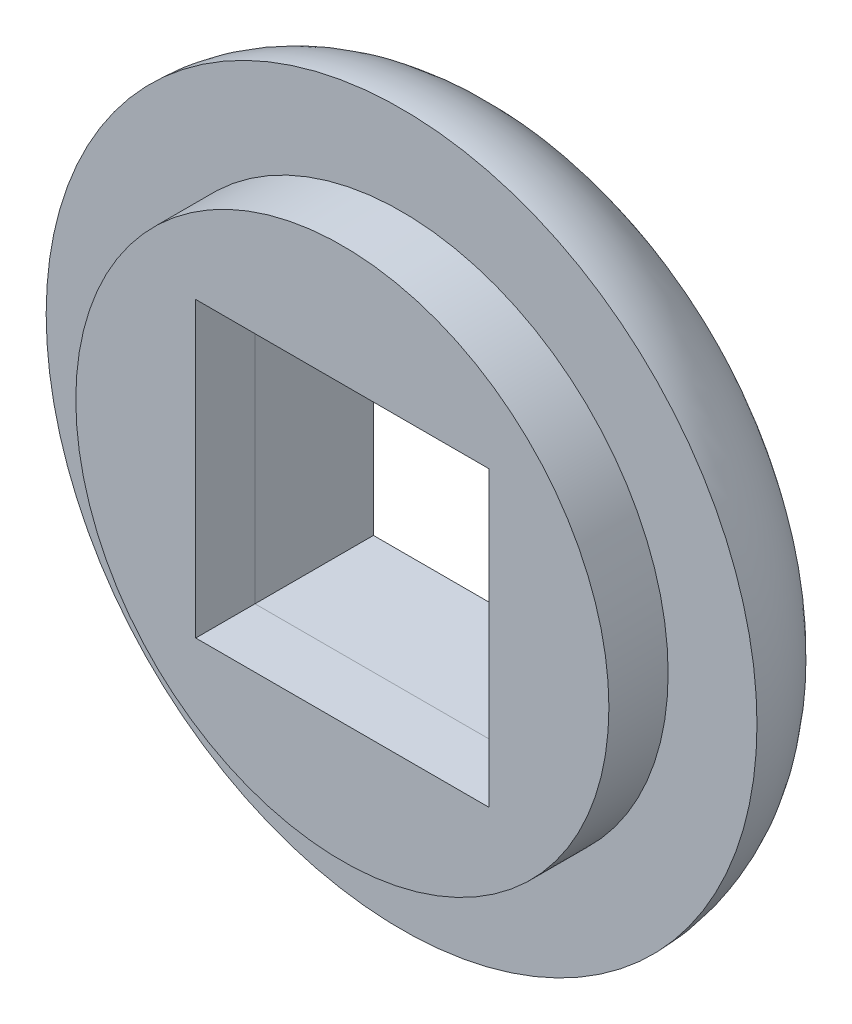
ISO-10303-21;
HEADER;
FILE_DESCRIPTION(('STEP AP214'),'2;1');
FILE_NAME('part.step','',(''),(''),'','','');
FILE_SCHEMA(('AUTOMOTIVE_DESIGN { 1 0 10303 214 1 1 1 1 }'));
ENDSEC;
DATA;
#1=APPLICATION_CONTEXT('core data for automotive mechanical design processes');
#2=APPLICATION_PROTOCOL_DEFINITION('international standard','automotive_design',2000,#1);
#3=PRODUCT_CONTEXT('',#1,'mechanical');
#4=PRODUCT('Part','Part','',(#3));
#5=PRODUCT_RELATED_PRODUCT_CATEGORY('part','',(#4));
#6=PRODUCT_DEFINITION_FORMATION('','',#4);
#7=PRODUCT_DEFINITION_CONTEXT('part definition',#1,'design');
#8=PRODUCT_DEFINITION('design','',#6,#7);
#9=PRODUCT_DEFINITION_SHAPE('','',#8);
#10=(LENGTH_UNIT() NAMED_UNIT(*) SI_UNIT(.MILLI.,.METRE.));
#11=(NAMED_UNIT(*) PLANE_ANGLE_UNIT() SI_UNIT($,.RADIAN.));
#12=(NAMED_UNIT(*) SI_UNIT($,.STERADIAN.) SOLID_ANGLE_UNIT());
#13=UNCERTAINTY_MEASURE_WITH_UNIT(LENGTH_MEASURE(1.E-05),#10,'distance_accuracy_value','');
#14=(GEOMETRIC_REPRESENTATION_CONTEXT(3) GLOBAL_UNCERTAINTY_ASSIGNED_CONTEXT((#13)) GLOBAL_UNIT_ASSIGNED_CONTEXT((#10,
#11,#12)) REPRESENTATION_CONTEXT('',''));
#15=CARTESIAN_POINT('',(0.,0.,0.));
#16=DIRECTION('',(0.,0.,1.));
#17=DIRECTION('',(1.,0.,0.));
#18=AXIS2_PLACEMENT_3D('',#15,#16,#17);
#19=CARTESIAN_POINT('',(0.,0.,-2.));
#20=DIRECTION('',(0.,0.,-1.));
#21=DIRECTION('',(-1.,0.,0.));
#22=AXIS2_PLACEMENT_3D('',#19,#20,#21);
#23=PLANE('',#22);
#24=CARTESIAN_POINT('',(0.,0.,-2.));
#25=DIRECTION('',(0.,0.,-1.));
#26=DIRECTION('',(-1.,0.,0.));
#27=AXIS2_PLACEMENT_3D('',#24,#25,#26);
#28=CIRCLE('',#27,4.);
#29=CARTESIAN_POINT('',(-4.,0.,-2.));
#30=VERTEX_POINT('',#29);
#31=EDGE_CURVE('E12',#30,#30,#28,.T.);
#32=ORIENTED_EDGE('',*,*,#31,.T.);
#33=EDGE_LOOP('',(#32));
#34=FACE_BOUND('',#33,.T.);
#35=DIRECTION('',(0.,-1.,0.));
#36=VECTOR('',#35,1.);
#37=CARTESIAN_POINT('',(2.47487373415292,2.47487373415292,-2.));
#38=LINE('',#37,#36);
#39=CARTESIAN_POINT('',(2.47487373415292,2.47487373415292,-2.));
#40=VERTEX_POINT('',#39);
#41=CARTESIAN_POINT('',(2.47487373415292,-2.47487373415292,-2.));
#42=VERTEX_POINT('',#41);
#43=EDGE_CURVE('E93',#40,#42,#38,.T.);
#44=ORIENTED_EDGE('',*,*,#43,.F.);
#45=DIRECTION('',(1.,0.,0.));
#46=VECTOR('',#45,1.);
#47=CARTESIAN_POINT('',(-2.47487373415292,2.47487373415292,-2.));
#48=LINE('',#47,#46);
#49=CARTESIAN_POINT('',(-2.47487373415292,2.47487373415292,-2.));
#50=VERTEX_POINT('',#49);
#51=EDGE_CURVE('E85',#50,#40,#48,.T.);
#52=ORIENTED_EDGE('',*,*,#51,.F.);
#53=DIRECTION('',(0.,1.,0.));
#54=VECTOR('',#53,1.);
#55=CARTESIAN_POINT('',(-2.47487373415292,-2.47487373415292,-2.));
#56=LINE('',#55,#54);
#57=CARTESIAN_POINT('',(-2.47487373415292,-2.47487373415292,-2.));
#58=VERTEX_POINT('',#57);
#59=EDGE_CURVE('E106',#58,#50,#56,.T.);
#60=ORIENTED_EDGE('',*,*,#59,.F.);
#61=DIRECTION('',(-1.,0.,0.));
#62=VECTOR('',#61,1.);
#63=CARTESIAN_POINT('',(2.47487373415292,-2.47487373415292,-2.));
#64=LINE('',#63,#62);
#65=EDGE_CURVE('E104',#42,#58,#64,.T.);
#66=ORIENTED_EDGE('',*,*,#65,.F.);
#67=EDGE_LOOP('',(#44,#52,#60,#66));
#68=FACE_BOUND('',#67,.T.);
#69=ADVANCED_FACE('F44',(#34,#68),#23,.T.);
#70=CARTESIAN_POINT('',(0.,0.,0.));
#71=DIRECTION('',(0.,0.,-1.));
#72=DIRECTION('',(-1.,0.,0.));
#73=AXIS2_PLACEMENT_3D('',#70,#71,#72);
#74=PLANE('',#73);
#75=CARTESIAN_POINT('',(0.,0.,0.));
#76=DIRECTION('',(0.,0.,-1.));
#77=DIRECTION('',(-1.,0.,0.));
#78=AXIS2_PLACEMENT_3D('',#75,#76,#77);
#79=CIRCLE('',#78,6.);
#80=CARTESIAN_POINT('',(-6.,0.,0.));
#81=VERTEX_POINT('',#80);
#82=EDGE_CURVE('E52',#81,#81,#79,.T.);
#83=ORIENTED_EDGE('',*,*,#82,.F.);
#84=EDGE_LOOP('',(#83));
#85=FACE_BOUND('',#84,.T.);
#86=DIRECTION('',(1.,0.,0.));
#87=VECTOR('',#86,1.);
#88=CARTESIAN_POINT('',(-2.47487373415292,2.47487373415292,0.));
#89=LINE('',#88,#87);
#90=CARTESIAN_POINT('',(-2.47487373415292,2.47487373415292,0.));
#91=VERTEX_POINT('',#90);
#92=CARTESIAN_POINT('',(2.47487373415292,2.47487373415292,0.));
#93=VERTEX_POINT('',#92);
#94=EDGE_CURVE('E67',#91,#93,#89,.T.);
#95=ORIENTED_EDGE('',*,*,#94,.T.);
#96=DIRECTION('',(0.,-1.,0.));
#97=VECTOR('',#96,1.);
#98=CARTESIAN_POINT('',(2.47487373415292,2.47487373415292,0.));
#99=LINE('',#98,#97);
#100=CARTESIAN_POINT('',(2.47487373415292,-2.47487373415292,0.));
#101=VERTEX_POINT('',#100);
#102=EDGE_CURVE('E100',#93,#101,#99,.T.);
#103=ORIENTED_EDGE('',*,*,#102,.T.);
#104=DIRECTION('',(-1.,0.,0.));
#105=VECTOR('',#104,1.);
#106=CARTESIAN_POINT('',(2.47487373415292,-2.47487373415292,0.));
#107=LINE('',#106,#105);
#108=CARTESIAN_POINT('',(-2.47487373415292,-2.47487373415292,0.));
#109=VERTEX_POINT('',#108);
#110=EDGE_CURVE('E112',#101,#109,#107,.T.);
#111=ORIENTED_EDGE('',*,*,#110,.T.);
#112=DIRECTION('',(0.,1.,0.));
#113=VECTOR('',#112,1.);
#114=CARTESIAN_POINT('',(-2.47487373415292,-2.47487373415292,0.));
#115=LINE('',#114,#113);
#116=EDGE_CURVE('E94',#109,#91,#115,.T.);
#117=ORIENTED_EDGE('',*,*,#116,.T.);
#118=EDGE_LOOP('',(#95,#103,#111,#117));
#119=FACE_BOUND('',#118,.T.);
#120=ADVANCED_FACE('F124',(#85,#119),#74,.F.);
#121=CARTESIAN_POINT('',(-2.47487373415292,2.47487373415292,-2.));
#122=DIRECTION('',(0.,-1.,0.));
#123=DIRECTION('',(1.,0.,0.));
#124=AXIS2_PLACEMENT_3D('',#121,#122,#123);
#125=PLANE('',#124);
#126=ORIENTED_EDGE('',*,*,#94,.F.);
#127=DIRECTION('',(0.,0.,1.));
#128=VECTOR('',#127,1.);
#129=CARTESIAN_POINT('',(-2.47487373415292,2.47487373415292,-2.));
#130=LINE('',#129,#128);
#131=EDGE_CURVE('E89',#50,#91,#130,.T.);
#132=ORIENTED_EDGE('',*,*,#131,.F.);
#133=ORIENTED_EDGE('',*,*,#51,.T.);
#134=DIRECTION('',(0.,0.,1.));
#135=VECTOR('',#134,1.);
#136=CARTESIAN_POINT('',(2.47487373415292,2.47487373415292,-2.));
#137=LINE('',#136,#135);
#138=EDGE_CURVE('E88',#40,#93,#137,.T.);
#139=ORIENTED_EDGE('',*,*,#138,.T.);
#140=EDGE_LOOP('',(#126,#132,#133,#139));
#141=FACE_BOUND('',#140,.T.);
#142=ADVANCED_FACE('F87',(#141),#125,.T.);
#143=CARTESIAN_POINT('',(2.47487373415292,2.47487373415292,-2.));
#144=DIRECTION('',(-1.,0.,0.));
#145=DIRECTION('',(0.,-1.,0.));
#146=AXIS2_PLACEMENT_3D('',#143,#144,#145);
#147=PLANE('',#146);
#148=ORIENTED_EDGE('',*,*,#102,.F.);
#149=ORIENTED_EDGE('',*,*,#138,.F.);
#150=ORIENTED_EDGE('',*,*,#43,.T.);
#151=DIRECTION('',(0.,0.,1.));
#152=VECTOR('',#151,1.);
#153=CARTESIAN_POINT('',(2.47487373415292,-2.47487373415292,-2.));
#154=LINE('',#153,#152);
#155=EDGE_CURVE('E101',#42,#101,#154,.T.);
#156=ORIENTED_EDGE('',*,*,#155,.T.);
#157=EDGE_LOOP('',(#148,#149,#150,#156));
#158=FACE_BOUND('',#157,.T.);
#159=ADVANCED_FACE('F97',(#158),#147,.T.);
#160=CARTESIAN_POINT('',(2.47487373415292,-2.47487373415292,-2.));
#161=DIRECTION('',(0.,1.,0.));
#162=DIRECTION('',(-1.,0.,0.));
#163=AXIS2_PLACEMENT_3D('',#160,#161,#162);
#164=PLANE('',#163);
#165=ORIENTED_EDGE('',*,*,#110,.F.);
#166=ORIENTED_EDGE('',*,*,#155,.F.);
#167=ORIENTED_EDGE('',*,*,#65,.T.);
#168=DIRECTION('',(0.,0.,1.));
#169=VECTOR('',#168,1.);
#170=CARTESIAN_POINT('',(-2.47487373415292,-2.47487373415292,-2.));
#171=LINE('',#170,#169);
#172=EDGE_CURVE('E59',#58,#109,#171,.T.);
#173=ORIENTED_EDGE('',*,*,#172,.T.);
#174=EDGE_LOOP('',(#165,#166,#167,#173));
#175=FACE_BOUND('',#174,.T.);
#176=ADVANCED_FACE('F130',(#175),#164,.T.);
#177=CARTESIAN_POINT('',(-2.47487373415292,-2.47487373415292,-2.));
#178=DIRECTION('',(1.,0.,0.));
#179=DIRECTION('',(0.,1.,0.));
#180=AXIS2_PLACEMENT_3D('',#177,#178,#179);
#181=PLANE('',#180);
#182=ORIENTED_EDGE('',*,*,#116,.F.);
#183=ORIENTED_EDGE('',*,*,#172,.F.);
#184=ORIENTED_EDGE('',*,*,#59,.T.);
#185=ORIENTED_EDGE('',*,*,#131,.T.);
#186=EDGE_LOOP('',(#182,#183,#184,#185));
#187=FACE_BOUND('',#186,.T.);
#188=ADVANCED_FACE('F128',(#187),#181,.T.);
#189=CARTESIAN_POINT('',(0.,0.,0.));
#190=DIRECTION('',(0.,0.,-1.));
#191=DIRECTION('',(-1.,0.,0.));
#192=AXIS2_PLACEMENT_3D('',#189,#190,#191);
#193=TOROIDAL_SURFACE('',#192,4.,2.);
#194=ORIENTED_EDGE('',*,*,#82,.T.);
#195=EDGE_LOOP('',(#194));
#196=FACE_BOUND('',#195,.T.);
#197=ORIENTED_EDGE('',*,*,#31,.F.);
#198=EDGE_LOOP('',(#197));
#199=FACE_BOUND('',#198,.T.);
#200=ADVANCED_FACE('F46',(#196,#199),#193,.T.);
#201=CLOSED_SHELL('',(#69,#120,#142,#159,#176,#188,#200));
#202=MANIFOLD_SOLID_BREP('B2',#201);
#203=CARTESIAN_POINT('',(0.,0.,1.));
#204=DIRECTION('',(0.,0.,1.));
#205=DIRECTION('',(1.,0.,0.));
#206=AXIS2_PLACEMENT_3D('',#203,#204,#205);
#207=PLANE('',#206);
#208=CARTESIAN_POINT('',(0.,0.,1.));
#209=DIRECTION('',(0.,0.,1.));
#210=DIRECTION('',(1.,0.,0.));
#211=AXIS2_PLACEMENT_3D('',#208,#209,#210);
#212=CIRCLE('',#211,4.5);
#213=CARTESIAN_POINT('',(4.5,0.,1.));
#214=VERTEX_POINT('',#213);
#215=EDGE_CURVE('E42',#214,#214,#212,.T.);
#216=ORIENTED_EDGE('',*,*,#215,.T.);
#217=EDGE_LOOP('',(#216));
#218=FACE_BOUND('',#217,.T.);
#219=DIRECTION('',(1.,0.,0.));
#220=VECTOR('',#219,1.);
#221=CARTESIAN_POINT('',(2.47487373415292,-2.47487373415292,1.));
#222=LINE('',#221,#220);
#223=CARTESIAN_POINT('',(-2.47487373415292,-2.47487373415292,1.));
#224=VERTEX_POINT('',#223);
#225=CARTESIAN_POINT('',(2.47487373415292,-2.47487373415292,1.));
#226=VERTEX_POINT('',#225);
#227=EDGE_CURVE('E237',#224,#226,#222,.T.);
#228=ORIENTED_EDGE('',*,*,#227,.F.);
#229=DIRECTION('',(0.,-1.,0.));
#230=VECTOR('',#229,1.);
#231=CARTESIAN_POINT('',(-2.47487373415292,2.47487373415292,1.));
#232=LINE('',#231,#230);
#233=CARTESIAN_POINT('',(-2.47487373415292,2.47487373415292,1.));
#234=VERTEX_POINT('',#233);
#235=EDGE_CURVE('E229',#234,#224,#232,.T.);
#236=ORIENTED_EDGE('',*,*,#235,.F.);
#237=DIRECTION('',(-1.,0.,0.));
#238=VECTOR('',#237,1.);
#239=CARTESIAN_POINT('',(2.47487373415292,2.47487373415292,1.));
#240=LINE('',#239,#238);
#241=CARTESIAN_POINT('',(2.47487373415292,2.47487373415292,1.));
#242=VERTEX_POINT('',#241);
#243=EDGE_CURVE('E250',#242,#234,#240,.T.);
#244=ORIENTED_EDGE('',*,*,#243,.F.);
#245=DIRECTION('',(0.,1.,0.));
#246=VECTOR('',#245,1.);
#247=CARTESIAN_POINT('',(2.47487373415292,2.47487373415292,1.));
#248=LINE('',#247,#246);
#249=EDGE_CURVE('E248',#226,#242,#248,.T.);
#250=ORIENTED_EDGE('',*,*,#249,.F.);
#251=EDGE_LOOP('',(#228,#236,#244,#250));
#252=FACE_BOUND('',#251,.T.);
#253=ADVANCED_FACE('F188',(#218,#252),#207,.T.);
#254=CARTESIAN_POINT('',(0.,0.,0.));
#255=DIRECTION('',(0.,0.,1.));
#256=DIRECTION('',(1.,0.,0.));
#257=AXIS2_PLACEMENT_3D('',#254,#255,#256);
#258=PLANE('',#257);
#259=CARTESIAN_POINT('',(0.,0.,0.));
#260=DIRECTION('',(0.,0.,1.));
#261=DIRECTION('',(1.,0.,0.));
#262=AXIS2_PLACEMENT_3D('',#259,#260,#261);
#263=CIRCLE('',#262,4.5);
#264=CARTESIAN_POINT('',(4.5,0.,0.));
#265=VERTEX_POINT('',#264);
#266=EDGE_CURVE('E192',#265,#265,#263,.T.);
#267=ORIENTED_EDGE('',*,*,#266,.F.);
#268=EDGE_LOOP('',(#267));
#269=FACE_BOUND('',#268,.T.);
#270=DIRECTION('',(0.,-1.,0.));
#271=VECTOR('',#270,1.);
#272=CARTESIAN_POINT('',(-2.47487373415292,2.47487373415292,0.));
#273=LINE('',#272,#271);
#274=CARTESIAN_POINT('',(-2.47487373415292,2.47487373415292,0.));
#275=VERTEX_POINT('',#274);
#276=CARTESIAN_POINT('',(-2.47487373415292,-2.47487373415292,0.));
#277=VERTEX_POINT('',#276);
#278=EDGE_CURVE('E211',#275,#277,#273,.T.);
#279=ORIENTED_EDGE('',*,*,#278,.T.);
#280=DIRECTION('',(1.,0.,0.));
#281=VECTOR('',#280,1.);
#282=CARTESIAN_POINT('',(2.47487373415292,-2.47487373415292,0.));
#283=LINE('',#282,#281);
#284=CARTESIAN_POINT('',(2.47487373415292,-2.47487373415292,0.));
#285=VERTEX_POINT('',#284);
#286=EDGE_CURVE('E244',#277,#285,#283,.T.);
#287=ORIENTED_EDGE('',*,*,#286,.T.);
#288=DIRECTION('',(0.,1.,0.));
#289=VECTOR('',#288,1.);
#290=CARTESIAN_POINT('',(2.47487373415292,2.47487373415292,0.));
#291=LINE('',#290,#289);
#292=CARTESIAN_POINT('',(2.47487373415292,2.47487373415292,0.));
#293=VERTEX_POINT('',#292);
#294=EDGE_CURVE('E256',#285,#293,#291,.T.);
#295=ORIENTED_EDGE('',*,*,#294,.T.);
#296=DIRECTION('',(-1.,0.,0.));
#297=VECTOR('',#296,1.);
#298=CARTESIAN_POINT('',(2.47487373415292,2.47487373415292,0.));
#299=LINE('',#298,#297);
#300=EDGE_CURVE('E238',#293,#275,#299,.T.);
#301=ORIENTED_EDGE('',*,*,#300,.T.);
#302=EDGE_LOOP('',(#279,#287,#295,#301));
#303=FACE_BOUND('',#302,.T.);
#304=ADVANCED_FACE('F267',(#269,#303),#258,.F.);
#305=CARTESIAN_POINT('',(0.,0.,1.));
#306=DIRECTION('',(0.,0.,-1.));
#307=DIRECTION('',(-1.,0.,0.));
#308=AXIS2_PLACEMENT_3D('',#305,#306,#307);
#309=CYLINDRICAL_SURFACE('',#308,4.5);
#310=ORIENTED_EDGE('',*,*,#215,.F.);
#311=EDGE_LOOP('',(#310));
#312=FACE_BOUND('',#311,.T.);
#313=ORIENTED_EDGE('',*,*,#266,.T.);
#314=EDGE_LOOP('',(#313));
#315=FACE_BOUND('',#314,.T.);
#316=ADVANCED_FACE('F190',(#312,#315),#309,.T.);
#317=CARTESIAN_POINT('',(-2.47487373415292,2.47487373415292,1.));
#318=DIRECTION('',(1.,0.,0.));
#319=DIRECTION('',(0.,1.,0.));
#320=AXIS2_PLACEMENT_3D('',#317,#318,#319);
#321=PLANE('',#320);
#322=ORIENTED_EDGE('',*,*,#278,.F.);
#323=DIRECTION('',(0.,0.,-1.));
#324=VECTOR('',#323,1.);
#325=CARTESIAN_POINT('',(-2.47487373415292,2.47487373415292,1.));
#326=LINE('',#325,#324);
#327=EDGE_CURVE('E233',#234,#275,#326,.T.);
#328=ORIENTED_EDGE('',*,*,#327,.F.);
#329=ORIENTED_EDGE('',*,*,#235,.T.);
#330=DIRECTION('',(0.,0.,-1.));
#331=VECTOR('',#330,1.);
#332=CARTESIAN_POINT('',(-2.47487373415292,-2.47487373415292,1.));
#333=LINE('',#332,#331);
#334=EDGE_CURVE('E232',#224,#277,#333,.T.);
#335=ORIENTED_EDGE('',*,*,#334,.T.);
#336=EDGE_LOOP('',(#322,#328,#329,#335));
#337=FACE_BOUND('',#336,.T.);
#338=ADVANCED_FACE('F231',(#337),#321,.T.);
#339=CARTESIAN_POINT('',(2.47487373415292,-2.47487373415292,1.));
#340=DIRECTION('',(0.,1.,0.));
#341=DIRECTION('',(-1.,0.,0.));
#342=AXIS2_PLACEMENT_3D('',#339,#340,#341);
#343=PLANE('',#342);
#344=ORIENTED_EDGE('',*,*,#286,.F.);
#345=ORIENTED_EDGE('',*,*,#334,.F.);
#346=ORIENTED_EDGE('',*,*,#227,.T.);
#347=DIRECTION('',(0.,0.,-1.));
#348=VECTOR('',#347,1.);
#349=CARTESIAN_POINT('',(2.47487373415292,-2.47487373415292,1.));
#350=LINE('',#349,#348);
#351=EDGE_CURVE('E245',#226,#285,#350,.T.);
#352=ORIENTED_EDGE('',*,*,#351,.T.);
#353=EDGE_LOOP('',(#344,#345,#346,#352));
#354=FACE_BOUND('',#353,.T.);
#355=ADVANCED_FACE('F241',(#354),#343,.T.);
#356=CARTESIAN_POINT('',(2.47487373415292,2.47487373415292,1.));
#357=DIRECTION('',(-1.,0.,0.));
#358=DIRECTION('',(0.,-1.,0.));
#359=AXIS2_PLACEMENT_3D('',#356,#357,#358);
#360=PLANE('',#359);
#361=ORIENTED_EDGE('',*,*,#294,.F.);
#362=ORIENTED_EDGE('',*,*,#351,.F.);
#363=ORIENTED_EDGE('',*,*,#249,.T.);
#364=DIRECTION('',(0.,0.,-1.));
#365=VECTOR('',#364,1.);
#366=CARTESIAN_POINT('',(2.47487373415292,2.47487373415292,1.));
#367=LINE('',#366,#365);
#368=EDGE_CURVE('E203',#242,#293,#367,.T.);
#369=ORIENTED_EDGE('',*,*,#368,.T.);
#370=EDGE_LOOP('',(#361,#362,#363,#369));
#371=FACE_BOUND('',#370,.T.);
#372=ADVANCED_FACE('F265',(#371),#360,.T.);
#373=CARTESIAN_POINT('',(2.47487373415292,2.47487373415292,1.));
#374=DIRECTION('',(0.,-1.,0.));
#375=DIRECTION('',(1.,0.,0.));
#376=AXIS2_PLACEMENT_3D('',#373,#374,#375);
#377=PLANE('',#376);
#378=ORIENTED_EDGE('',*,*,#300,.F.);
#379=ORIENTED_EDGE('',*,*,#368,.F.);
#380=ORIENTED_EDGE('',*,*,#243,.T.);
#381=ORIENTED_EDGE('',*,*,#327,.T.);
#382=EDGE_LOOP('',(#378,#379,#380,#381));
#383=FACE_BOUND('',#382,.T.);
#384=ADVANCED_FACE('F268',(#383),#377,.T.);
#385=CLOSED_SHELL('',(#253,#304,#316,#338,#355,#372,#384));
#386=MANIFOLD_SOLID_BREP('B6',#385);
#387=ADVANCED_BREP_SHAPE_REPRESENTATION('',(#18,#202,#386),#14);
#388=SHAPE_DEFINITION_REPRESENTATION(#9,#387);
ENDSEC;
END-ISO-10303-21;
